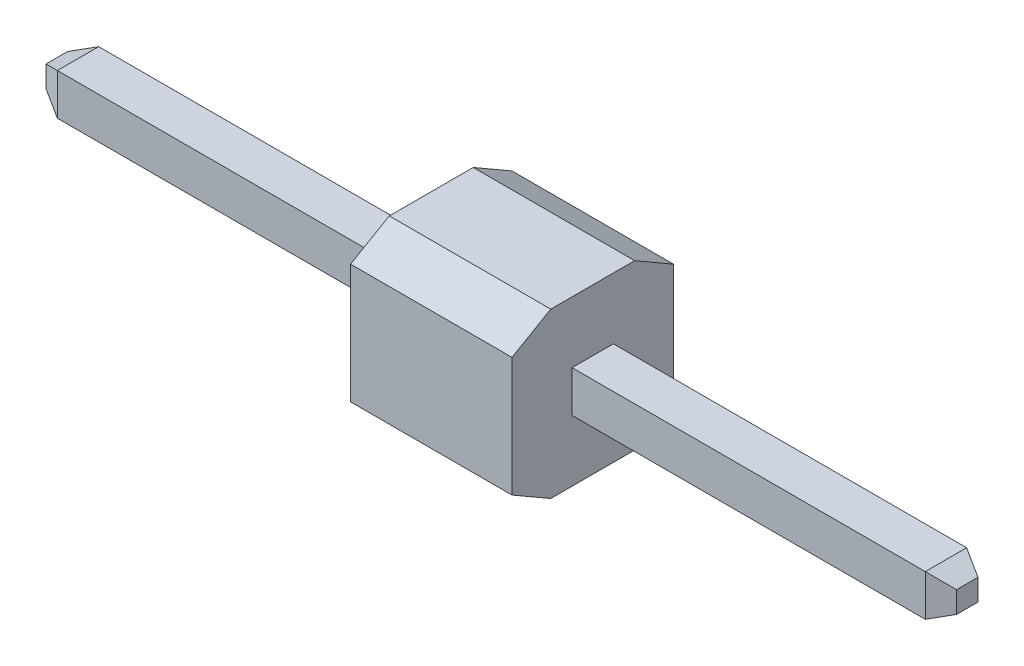
ISO-10303-21;
HEADER;
FILE_DESCRIPTION(('STEP AP214'),'2;1');
FILE_NAME('part.step','',(''),(''),'','','');
FILE_SCHEMA(('AUTOMOTIVE_DESIGN { 1 0 10303 214 1 1 1 1 }'));
ENDSEC;
DATA;
#1=APPLICATION_CONTEXT('core data for automotive mechanical design processes');
#2=APPLICATION_PROTOCOL_DEFINITION('international standard','automotive_design',2000,#1);
#3=PRODUCT_CONTEXT('',#1,'mechanical');
#4=PRODUCT('Part','Part','',(#3));
#5=PRODUCT_RELATED_PRODUCT_CATEGORY('part','',(#4));
#6=PRODUCT_DEFINITION_FORMATION('','',#4);
#7=PRODUCT_DEFINITION_CONTEXT('part definition',#1,'design');
#8=PRODUCT_DEFINITION('design','',#6,#7);
#9=PRODUCT_DEFINITION_SHAPE('','',#8);
#10=(LENGTH_UNIT() NAMED_UNIT(*) SI_UNIT(.MILLI.,.METRE.));
#11=(NAMED_UNIT(*) PLANE_ANGLE_UNIT() SI_UNIT($,.RADIAN.));
#12=(NAMED_UNIT(*) SI_UNIT($,.STERADIAN.) SOLID_ANGLE_UNIT());
#13=UNCERTAINTY_MEASURE_WITH_UNIT(LENGTH_MEASURE(1.E-05),#10,'distance_accuracy_value','');
#14=(GEOMETRIC_REPRESENTATION_CONTEXT(3) GLOBAL_UNCERTAINTY_ASSIGNED_CONTEXT((#13)) GLOBAL_UNIT_ASSIGNED_CONTEXT((#10,
#11,#12)) REPRESENTATION_CONTEXT('',''));
#15=CARTESIAN_POINT('',(0.,0.,0.));
#16=DIRECTION('',(0.,0.,1.));
#17=DIRECTION('',(1.,0.,0.));
#18=AXIS2_PLACEMENT_3D('',#15,#16,#17);
#19=CARTESIAN_POINT('',(5.42105186596663,10.477121448103,-2.62999914262417));
#20=DIRECTION('',(1.,-9.93476518829084E-08,4.37113882867379E-08));
#21=DIRECTION('',(-9.93476589883358E-08,-1.,8.74227765734759E-08));
#22=AXIS2_PLACEMENT_3D('',#19,#20,#21);
#23=PLANE('',#22);
#24=DIRECTION('',(-1.18186619959584E-08,-0.50000007571054,-0.866025360072934));
#25=VECTOR('',#24,1.);
#26=CARTESIAN_POINT('',(5.42105167379203,9.23353174686681,-1.05999903390609));
#27=LINE('',#26,#25);
#28=CARTESIAN_POINT('',(5.42105167379203,9.23353174686681,-1.05999903390609));
#29=VERTEX_POINT('',#28);
#30=CARTESIAN_POINT('',(5.42105166560382,8.88712153290314,-1.65999900362196));
#31=VERTEX_POINT('',#30);
#32=EDGE_CURVE('E11',#29,#31,#27,.T.);
#33=ORIENTED_EDGE('',*,*,#32,.T.);
#34=DIRECTION('',(4.37113811813104E-08,-8.74227842254741E-08,-0.999999999999995));
#35=VECTOR('',#34,1.);
#36=CARTESIAN_POINT('',(5.42105166560382,8.88712153290314,-1.65999900362196));
#37=LINE('',#36,#35);
#38=CARTESIAN_POINT('',(5.42105172242861,8.88712141925352,-2.95999900362196));
#39=VERTEX_POINT('',#38);
#40=EDGE_CURVE('E304',#31,#39,#37,.T.);
#41=ORIENTED_EDGE('',*,*,#40,.T.);
#42=DIRECTION('',(8.75289950712042E-08,0.499999924289839,-0.866025447495712));
#43=VECTOR('',#42,1.);
#44=CARTESIAN_POINT('',(5.42105172242861,8.88712141925352,-2.95999900362196));
#45=LINE('',#44,#43);
#46=CARTESIAN_POINT('',(5.42105178307048,9.23353152830985,-3.55999903390609));
#47=VERTEX_POINT('',#46);
#48=EDGE_CURVE('E296',#39,#47,#45,.T.);
#49=ORIENTED_EDGE('',*,*,#48,.T.);
#50=DIRECTION('',(9.93476593244772E-08,0.999999999999991,-8.74227767226935E-08));
#51=VECTOR('',#50,1.);
#52=CARTESIAN_POINT('',(5.42105178307048,9.23353152830985,-3.55999903390609));
#53=LINE('',#52,#51);
#54=CARTESIAN_POINT('',(5.42105196658346,11.0807112052799,-3.55999919539167));
#55=VERTEX_POINT('',#54);
#56=EDGE_CURVE('E281',#47,#55,#53,.T.);
#57=ORIENTED_EDGE('',*,*,#56,.T.);
#58=DIRECTION('',(-1.18186619958732E-08,-0.500000075710534,-0.866025360072937));
#59=VECTOR('',#58,1.);
#60=CARTESIAN_POINT('',(5.42105197477167,11.4271214192535,-2.95999922567581));
#61=LINE('',#60,#59);
#62=CARTESIAN_POINT('',(5.42105197477167,11.4271214192535,-2.95999922567581));
#63=VERTEX_POINT('',#62);
#64=EDGE_CURVE('E265',#63,#55,#61,.T.);
#65=ORIENTED_EDGE('',*,*,#64,.F.);
#66=DIRECTION('',(4.37113811813104E-08,-8.74227842254741E-08,-0.999999999999995));
#67=VECTOR('',#66,1.);
#68=CARTESIAN_POINT('',(5.42105191794687,11.4271215329031,-1.65999922567581));
#69=LINE('',#68,#67);
#70=CARTESIAN_POINT('',(5.42105191794687,11.4271215329031,-1.65999922567581));
#71=VERTEX_POINT('',#70);
#72=EDGE_CURVE('E248',#71,#63,#69,.T.);
#73=ORIENTED_EDGE('',*,*,#72,.F.);
#74=DIRECTION('',(8.7528995070573E-08,0.499999924289833,-0.866025447495715));
#75=VECTOR('',#74,1.);
#76=CARTESIAN_POINT('',(5.421051857305,11.0807114238368,-1.05999919539167));
#77=LINE('',#76,#75);
#78=CARTESIAN_POINT('',(5.421051857305,11.0807114238368,-1.05999919539167));
#79=VERTEX_POINT('',#78);
#80=EDGE_CURVE('E242',#79,#71,#77,.T.);
#81=ORIENTED_EDGE('',*,*,#80,.F.);
#82=DIRECTION('',(9.93476593244772E-08,0.999999999999991,-8.74227763620714E-08));
#83=VECTOR('',#82,1.);
#84=CARTESIAN_POINT('',(5.42105167379203,9.23353174686681,-1.05999903390609));
#85=LINE('',#84,#83);
#86=EDGE_CURVE('E236',#29,#79,#85,.T.);
#87=ORIENTED_EDGE('',*,*,#86,.F.);
#88=EDGE_LOOP('',(#33,#41,#49,#57,#65,#73,#81,#87));
#89=FACE_BOUND('',#88,.T.);
#90=DIRECTION('',(-4.37113803486431E-08,8.74227856773043E-08,0.999999999999995));
#91=VECTOR('',#90,1.);
#92=CARTESIAN_POINT('',(5.42105180238413,9.83712144810304,-2.62999908667359));
#93=LINE('',#92,#91);
#94=CARTESIAN_POINT('',(5.42105180238413,9.83712144810304,-2.62999908667359));
#95=VERTEX_POINT('',#94);
#96=CARTESIAN_POINT('',(5.42105177440885,9.83712150405362,-1.98999908667359));
#97=VERTEX_POINT('',#96);
#98=EDGE_CURVE('E302',#95,#97,#93,.T.);
#99=ORIENTED_EDGE('',*,*,#98,.T.);
#100=DIRECTION('',(-9.93476592658906E-08,-0.999999999999991,8.74227763097971E-08));
#101=VECTOR('',#100,1.);
#102=CARTESIAN_POINT('',(5.42105183799135,10.4771215040536,-1.98999914262417));
#103=LINE('',#102,#101);
#104=CARTESIAN_POINT('',(5.42105183799135,10.4771215040536,-1.98999914262417));
#105=VERTEX_POINT('',#104);
#106=EDGE_CURVE('E293',#105,#97,#103,.T.);
#107=ORIENTED_EDGE('',*,*,#106,.F.);
#108=DIRECTION('',(-4.37113803486431E-08,8.74227856773042E-08,0.999999999999995));
#109=VECTOR('',#108,1.);
#110=CARTESIAN_POINT('',(5.42105186596663,10.477121448103,-2.62999914262417));
#111=LINE('',#110,#109);
#112=CARTESIAN_POINT('',(5.42105186596663,10.477121448103,-2.62999914262417));
#113=VERTEX_POINT('',#112);
#114=EDGE_CURVE('E278',#113,#105,#111,.T.);
#115=ORIENTED_EDGE('',*,*,#114,.F.);
#116=DIRECTION('',(-9.93476592658906E-08,-0.999999999999991,8.74227766567418E-08));
#117=VECTOR('',#116,1.);
#118=CARTESIAN_POINT('',(5.42105186596663,10.477121448103,-2.62999914262417));
#119=LINE('',#118,#117);
#120=EDGE_CURVE('E263',#113,#95,#119,.T.);
#121=ORIENTED_EDGE('',*,*,#120,.T.);
#122=EDGE_LOOP('',(#99,#107,#115,#121));
#123=FACE_BOUND('',#122,.T.);
#124=ADVANCED_FACE('F17',(#89,#123),#23,.T.);
#125=CARTESIAN_POINT('',(2.92105186596663,10.4771216964722,-2.62999925190264));
#126=DIRECTION('',(1.,-9.93476518829084E-08,4.37113882867379E-08));
#127=DIRECTION('',(-9.93476589883358E-08,-1.,8.74227765734759E-08));
#128=AXIS2_PLACEMENT_3D('',#125,#126,#127);
#129=PLANE('',#128);
#130=DIRECTION('',(-1.18186632779335E-08,-0.50000007571054,-0.866025360072934));
#131=VECTOR('',#130,1.);
#132=CARTESIAN_POINT('',(2.92105167379203,9.23353199523594,-1.05999914318456));
#133=LINE('',#132,#131);
#134=CARTESIAN_POINT('',(2.92105167379203,9.23353199523594,-1.05999914318456));
#135=VERTEX_POINT('',#134);
#136=CARTESIAN_POINT('',(2.92105166560382,8.88712178127227,-1.65999911290043));
#137=VERTEX_POINT('',#136);
#138=EDGE_CURVE('E24',#135,#137,#133,.T.);
#139=ORIENTED_EDGE('',*,*,#138,.F.);
#140=DIRECTION('',(9.93476588436478E-08,0.999999999999991,-8.74227763620714E-08));
#141=VECTOR('',#140,1.);
#142=CARTESIAN_POINT('',(2.92105167379203,9.23353199523594,-1.05999914318456));
#143=LINE('',#142,#141);
#144=CARTESIAN_POINT('',(2.921051857305,11.0807116722059,-1.05999930467014));
#145=VERTEX_POINT('',#144);
#146=EDGE_CURVE('E300',#135,#145,#143,.T.);
#147=ORIENTED_EDGE('',*,*,#146,.T.);
#148=DIRECTION('',(8.75289963525482E-08,0.499999924289833,-0.866025447495715));
#149=VECTOR('',#148,1.);
#150=CARTESIAN_POINT('',(2.921051857305,11.0807116722059,-1.05999930467014));
#151=LINE('',#150,#149);
#152=CARTESIAN_POINT('',(2.92105191794687,11.4271217812723,-1.65999933495428));
#153=VERTEX_POINT('',#152);
#154=EDGE_CURVE('E286',#145,#153,#151,.T.);
#155=ORIENTED_EDGE('',*,*,#154,.T.);
#156=DIRECTION('',(4.37113811813104E-08,-8.74227842254741E-08,-0.999999999999995));
#157=VECTOR('',#156,1.);
#158=CARTESIAN_POINT('',(2.92105191794687,11.4271217812723,-1.65999933495428));
#159=LINE('',#158,#157);
#160=CARTESIAN_POINT('',(2.92105197477167,11.4271216676226,-2.95999933495428));
#161=VERTEX_POINT('',#160);
#162=EDGE_CURVE('E271',#153,#161,#159,.T.);
#163=ORIENTED_EDGE('',*,*,#162,.T.);
#164=DIRECTION('',(-1.18186632778483E-08,-0.500000075710534,-0.866025360072937));
#165=VECTOR('',#164,1.);
#166=CARTESIAN_POINT('',(2.92105197477167,11.4271216676226,-2.95999933495428));
#167=LINE('',#166,#165);
#168=CARTESIAN_POINT('',(2.92105196658346,11.080711453649,-3.55999930467014));
#169=VERTEX_POINT('',#168);
#170=EDGE_CURVE('E253',#161,#169,#167,.T.);
#171=ORIENTED_EDGE('',*,*,#170,.T.);
#172=DIRECTION('',(9.93476588436478E-08,0.999999999999991,-8.74227767226935E-08));
#173=VECTOR('',#172,1.);
#174=CARTESIAN_POINT('',(2.92105178307048,9.23353177667898,-3.55999914318456));
#175=LINE('',#174,#173);
#176=CARTESIAN_POINT('',(2.92105178307048,9.23353177667898,-3.55999914318456));
#177=VERTEX_POINT('',#176);
#178=EDGE_CURVE('E261',#177,#169,#175,.T.);
#179=ORIENTED_EDGE('',*,*,#178,.F.);
#180=DIRECTION('',(8.75289963531793E-08,0.499999924289839,-0.866025447495712));
#181=VECTOR('',#180,1.);
#182=CARTESIAN_POINT('',(2.92105172242861,8.88712166762265,-2.95999911290043));
#183=LINE('',#182,#181);
#184=CARTESIAN_POINT('',(2.92105172242861,8.88712166762265,-2.95999911290043));
#185=VERTEX_POINT('',#184);
#186=EDGE_CURVE('E276',#185,#177,#183,.T.);
#187=ORIENTED_EDGE('',*,*,#186,.F.);
#188=DIRECTION('',(4.37113811813104E-08,-8.74227842254741E-08,-0.999999999999995));
#189=VECTOR('',#188,1.);
#190=CARTESIAN_POINT('',(2.92105166560382,8.88712178127227,-1.65999911290043));
#191=LINE('',#190,#189);
#192=EDGE_CURVE('E291',#137,#185,#191,.T.);
#193=ORIENTED_EDGE('',*,*,#192,.F.);
#194=EDGE_LOOP('',(#139,#147,#155,#163,#171,#179,#187,#193));
#195=FACE_BOUND('',#194,.T.);
#196=DIRECTION('',(-9.93476585720012E-08,-0.999999999999991,8.74227763097971E-08));
#197=VECTOR('',#196,1.);
#198=CARTESIAN_POINT('',(2.92105183799135,10.4771217524227,-1.98999925190264));
#199=LINE('',#198,#197);
#200=CARTESIAN_POINT('',(2.92105183799135,10.4771217524227,-1.98999925190264));
#201=VERTEX_POINT('',#200);
#202=CARTESIAN_POINT('',(2.92105177440885,9.83712175242275,-1.98999919595206));
#203=VERTEX_POINT('',#202);
#204=EDGE_CURVE('E298',#201,#203,#199,.T.);
#205=ORIENTED_EDGE('',*,*,#204,.T.);
#206=DIRECTION('',(-4.37113810425325E-08,8.74227856773043E-08,0.999999999999995));
#207=VECTOR('',#206,1.);
#208=CARTESIAN_POINT('',(2.92105180238413,9.83712169647217,-2.62999919595206));
#209=LINE('',#208,#207);
#210=CARTESIAN_POINT('',(2.92105180238413,9.83712169647217,-2.62999919595206));
#211=VERTEX_POINT('',#210);
#212=EDGE_CURVE('E283',#211,#203,#209,.T.);
#213=ORIENTED_EDGE('',*,*,#212,.F.);
#214=DIRECTION('',(-9.93476585720012E-08,-0.999999999999991,8.74227766567418E-08));
#215=VECTOR('',#214,1.);
#216=CARTESIAN_POINT('',(2.92105186596663,10.4771216964722,-2.62999925190264));
#217=LINE('',#216,#215);
#218=CARTESIAN_POINT('',(2.92105186596663,10.4771216964722,-2.62999925190264));
#219=VERTEX_POINT('',#218);
#220=EDGE_CURVE('E268',#219,#211,#217,.T.);
#221=ORIENTED_EDGE('',*,*,#220,.F.);
#222=DIRECTION('',(-4.37113810425325E-08,8.74227856773042E-08,0.999999999999995));
#223=VECTOR('',#222,1.);
#224=CARTESIAN_POINT('',(2.92105186596663,10.4771216964722,-2.62999925190264));
#225=LINE('',#224,#223);
#226=EDGE_CURVE('E251',#219,#201,#225,.T.);
#227=ORIENTED_EDGE('',*,*,#226,.T.);
#228=EDGE_LOOP('',(#205,#213,#221,#227));
#229=FACE_BOUND('',#228,.T.);
#230=ADVANCED_FACE('F314',(#195,#229),#129,.F.);
#231=CARTESIAN_POINT('',(5.42105167379203,9.23353174686681,-1.05999903390609));
#232=DIRECTION('',(1.07893287081065E-07,0.866025360072937,-0.500000075710535));
#233=DIRECTION('',(1.18186629566715E-08,0.500000075710542,0.866025360072941));
#234=AXIS2_PLACEMENT_3D('',#231,#232,#233);
#235=PLANE('',#234);
#236=ORIENTED_EDGE('',*,*,#138,.T.);
#237=DIRECTION('',(-0.999999999999994,9.93476504618223E-08,-4.37113884643734E-08));
#238=VECTOR('',#237,1.);
#239=CARTESIAN_POINT('',(5.42105166560382,8.88712153290314,-1.65999900362196));
#240=LINE('',#239,#238);
#241=EDGE_CURVE('E288',#31,#137,#240,.T.);
#242=ORIENTED_EDGE('',*,*,#241,.F.);
#243=ORIENTED_EDGE('',*,*,#32,.F.);
#244=DIRECTION('',(-0.999999999999994,9.93476533039933E-08,-4.3711388109102E-08));
#245=VECTOR('',#244,1.);
#246=CARTESIAN_POINT('',(5.42105167379203,9.23353174686681,-1.05999903390609));
#247=LINE('',#246,#245);
#248=EDGE_CURVE('E256',#29,#135,#247,.T.);
#249=ORIENTED_EDGE('',*,*,#248,.T.);
#250=EDGE_LOOP('',(#236,#242,#243,#249));
#251=FACE_BOUND('',#250,.T.);
#252=ADVANCED_FACE('F306',(#251),#235,.F.);
#253=CARTESIAN_POINT('',(5.42105166560382,8.88712153290314,-1.65999900362196));
#254=DIRECTION('',(9.93476589883358E-08,1.,-8.74227765734759E-08));
#255=DIRECTION('',(1.,-9.93476518829084E-08,4.37113882867379E-08));
#256=AXIS2_PLACEMENT_3D('',#253,#254,#255);
#257=PLANE('',#256);
#258=ORIENTED_EDGE('',*,*,#192,.T.);
#259=DIRECTION('',(-0.999999999999994,9.93476504618223E-08,-4.37113882867377E-08));
#260=VECTOR('',#259,1.);
#261=CARTESIAN_POINT('',(5.42105172242861,8.88712141925352,-2.95999900362196));
#262=LINE('',#261,#260);
#263=EDGE_CURVE('E273',#39,#185,#262,.T.);
#264=ORIENTED_EDGE('',*,*,#263,.F.);
#265=ORIENTED_EDGE('',*,*,#40,.F.);
#266=ORIENTED_EDGE('',*,*,#241,.T.);
#267=EDGE_LOOP('',(#258,#264,#265,#266));
#268=FACE_BOUND('',#267,.T.);
#269=ADVANCED_FACE('F311',(#268),#257,.F.);
#270=CARTESIAN_POINT('',(5.42105172242861,8.88712141925352,-2.95999900362196));
#271=DIRECTION('',(6.41819058997377E-08,0.866025447495721,0.499999924289845));
#272=DIRECTION('',(-8.7528996031702E-08,-0.499999924289838,0.866025447495717));
#273=AXIS2_PLACEMENT_3D('',#270,#271,#272);
#274=PLANE('',#273);
#275=ORIENTED_EDGE('',*,*,#186,.T.);
#276=DIRECTION('',(-0.999999999999994,9.93476533039933E-08,-4.37113884643734E-08));
#277=VECTOR('',#276,1.);
#278=CARTESIAN_POINT('',(5.42105178307048,9.23353152830985,-3.55999903390609));
#279=LINE('',#278,#277);
#280=EDGE_CURVE('E258',#47,#177,#279,.T.);
#281=ORIENTED_EDGE('',*,*,#280,.F.);
#282=ORIENTED_EDGE('',*,*,#48,.F.);
#283=ORIENTED_EDGE('',*,*,#263,.T.);
#284=EDGE_LOOP('',(#275,#281,#282,#283));
#285=FACE_BOUND('',#284,.T.);
#286=ADVANCED_FACE('F319',(#285),#274,.F.);
#287=CARTESIAN_POINT('',(5.42105178307048,9.23353152830985,-3.55999903390609));
#288=DIRECTION('',(-4.37113811813106E-08,8.74227836789032E-08,1.));
#289=DIRECTION('',(-1.,9.93476518829084E-08,-4.37113882867379E-08));
#290=AXIS2_PLACEMENT_3D('',#287,#288,#289);
#291=PLANE('',#290);
#292=ORIENTED_EDGE('',*,*,#178,.T.);
#293=DIRECTION('',(-0.999999999999994,9.93476533039933E-08,-4.37113882867377E-08));
#294=VECTOR('',#293,1.);
#295=CARTESIAN_POINT('',(5.42105196658346,11.0807112052799,-3.55999919539167));
#296=LINE('',#295,#294);
#297=EDGE_CURVE('E245',#55,#169,#296,.T.);
#298=ORIENTED_EDGE('',*,*,#297,.F.);
#299=ORIENTED_EDGE('',*,*,#56,.F.);
#300=ORIENTED_EDGE('',*,*,#280,.T.);
#301=EDGE_LOOP('',(#292,#298,#299,#300));
#302=FACE_BOUND('',#301,.T.);
#303=ADVANCED_FACE('F326',(#302),#291,.F.);
#304=CARTESIAN_POINT('',(5.42105197477167,11.4271214192535,-2.95999922567581));
#305=DIRECTION('',(1.07893287081065E-07,0.866025360072937,-0.500000075710535));
#306=DIRECTION('',(1.18186629566715E-08,0.500000075710542,0.866025360072941));
#307=AXIS2_PLACEMENT_3D('',#304,#305,#306);
#308=PLANE('',#307);
#309=ORIENTED_EDGE('',*,*,#170,.F.);
#310=DIRECTION('',(-0.999999999999994,9.93476533039933E-08,-4.37113884643734E-08));
#311=VECTOR('',#310,1.);
#312=CARTESIAN_POINT('',(5.42105197477167,11.4271214192535,-2.95999922567581));
#313=LINE('',#312,#311);
#314=EDGE_CURVE('E239',#63,#161,#313,.T.);
#315=ORIENTED_EDGE('',*,*,#314,.F.);
#316=ORIENTED_EDGE('',*,*,#64,.T.);
#317=ORIENTED_EDGE('',*,*,#297,.T.);
#318=EDGE_LOOP('',(#309,#315,#316,#317));
#319=FACE_BOUND('',#318,.T.);
#320=ADVANCED_FACE('F329',(#319),#308,.T.);
#321=CARTESIAN_POINT('',(5.42105191794687,11.4271215329031,-1.65999922567581));
#322=DIRECTION('',(9.93476589883358E-08,1.,-8.74227765734759E-08));
#323=DIRECTION('',(1.,-9.93476518829084E-08,4.37113882867379E-08));
#324=AXIS2_PLACEMENT_3D('',#321,#322,#323);
#325=PLANE('',#324);
#326=ORIENTED_EDGE('',*,*,#162,.F.);
#327=DIRECTION('',(-0.999999999999994,9.93476533039933E-08,-4.37113883755555E-08));
#328=VECTOR('',#327,1.);
#329=CARTESIAN_POINT('',(5.42105191794687,11.4271215329031,-1.65999922567581));
#330=LINE('',#329,#328);
#331=EDGE_CURVE('E233',#71,#153,#330,.T.);
#332=ORIENTED_EDGE('',*,*,#331,.F.);
#333=ORIENTED_EDGE('',*,*,#72,.T.);
#334=ORIENTED_EDGE('',*,*,#314,.T.);
#335=EDGE_LOOP('',(#326,#332,#333,#334));
#336=FACE_BOUND('',#335,.T.);
#337=ADVANCED_FACE('F333',(#336),#325,.T.);
#338=CARTESIAN_POINT('',(5.421051857305,11.0807114238368,-1.05999919539167));
#339=DIRECTION('',(6.41819058997377E-08,0.866025447495721,0.499999924289845));
#340=DIRECTION('',(-8.7528996031702E-08,-0.499999924289838,0.866025447495717));
#341=AXIS2_PLACEMENT_3D('',#338,#339,#340);
#342=PLANE('',#341);
#343=ORIENTED_EDGE('',*,*,#154,.F.);
#344=DIRECTION('',(-0.999999999999994,9.93476533039933E-08,-4.3711388109102E-08));
#345=VECTOR('',#344,1.);
#346=CARTESIAN_POINT('',(5.421051857305,11.0807114238368,-1.05999919539167));
#347=LINE('',#346,#345);
#348=EDGE_CURVE('E230',#79,#145,#347,.T.);
#349=ORIENTED_EDGE('',*,*,#348,.F.);
#350=ORIENTED_EDGE('',*,*,#80,.T.);
#351=ORIENTED_EDGE('',*,*,#331,.T.);
#352=EDGE_LOOP('',(#343,#349,#350,#351));
#353=FACE_BOUND('',#352,.T.);
#354=ADVANCED_FACE('F337',(#353),#342,.T.);
#355=CARTESIAN_POINT('',(5.42105167379203,9.23353174686681,-1.05999903390609));
#356=DIRECTION('',(-4.37113811813106E-08,8.74227835615132E-08,1.));
#357=DIRECTION('',(-9.93476589883358E-08,-1.,8.74227764560859E-08));
#358=AXIS2_PLACEMENT_3D('',#355,#356,#357);
#359=PLANE('',#358);
#360=ORIENTED_EDGE('',*,*,#146,.F.);
#361=ORIENTED_EDGE('',*,*,#248,.F.);
#362=ORIENTED_EDGE('',*,*,#86,.T.);
#363=ORIENTED_EDGE('',*,*,#348,.T.);
#364=EDGE_LOOP('',(#360,#361,#362,#363));
#365=FACE_BOUND('',#364,.T.);
#366=ADVANCED_FACE('F339',(#365),#359,.T.);
#367=CARTESIAN_POINT('',(-2.87894813403337,10.4771222726885,-2.62999950542869));
#368=DIRECTION('',(-1.,9.93476518829084E-08,-4.37113882867379E-08));
#369=DIRECTION('',(9.93476589883358E-08,1.,-8.74227765734759E-08));
#370=AXIS2_PLACEMENT_3D('',#367,#368,#369);
#371=PLANE('',#370);
#372=DIRECTION('',(9.93476608211201E-08,0.999999999999991,-8.74227774781761E-08));
#373=VECTOR('',#372,1.);
#374=CARTESIAN_POINT('',(-2.87894820357701,9.99100384237638,-2.14388099012187));
#375=LINE('',#374,#373);
#376=CARTESIAN_POINT('',(-2.87894820357701,9.99100384237638,-2.14388099012187));
#377=VERTEX_POINT('',#376);
#378=CARTESIAN_POINT('',(-2.87894817057004,10.3232407879864,-2.14388101916694));
#379=VERTEX_POINT('',#378);
#380=EDGE_CURVE('E228',#377,#379,#375,.T.);
#381=ORIENTED_EDGE('',*,*,#380,.T.);
#382=DIRECTION('',(4.37113820547149E-08,-8.7422774802743E-08,-0.999999999999995));
#383=VECTOR('',#382,1.);
#384=CARTESIAN_POINT('',(-2.87894817057005,10.3232407879864,-2.14388101916694));
#385=LINE('',#384,#383);
#386=CARTESIAN_POINT('',(-2.87894815604751,10.3232407589413,-2.47611796478494));
#387=VERTEX_POINT('',#386);
#388=EDGE_CURVE('E223',#379,#387,#385,.T.);
#389=ORIENTED_EDGE('',*,*,#388,.T.);
#390=DIRECTION('',(-9.93476608211201E-08,-0.999999999999991,8.7422776141512E-08));
#391=VECTOR('',#390,1.);
#392=CARTESIAN_POINT('',(-2.87894815604751,10.3232407589413,-2.47611796478494));
#393=LINE('',#392,#391);
#394=CARTESIAN_POINT('',(-2.87894818905447,9.9910038133313,-2.47611793573987));
#395=VERTEX_POINT('',#394);
#396=EDGE_CURVE('E215',#387,#395,#393,.T.);
#397=ORIENTED_EDGE('',*,*,#396,.T.);
#398=DIRECTION('',(-4.37113767080583E-08,8.74227854960559E-08,0.999999999999995));
#399=VECTOR('',#398,1.);
#400=CARTESIAN_POINT('',(-2.87894818905447,9.9910038133313,-2.47611793573987));
#401=LINE('',#400,#399);
#402=EDGE_CURVE('E207',#395,#377,#401,.T.);
#403=ORIENTED_EDGE('',*,*,#402,.T.);
#404=EDGE_LOOP('',(#381,#389,#397,#403));
#405=FACE_BOUND('',#404,.T.);
#406=ADVANCED_FACE('F341',(#405),#371,.T.);
#407=CARTESIAN_POINT('',(-2.87894813403337,10.4771222726885,-2.62999950542869));
#408=DIRECTION('',(9.93476589883358E-08,1.,-8.74227764510112E-08));
#409=DIRECTION('',(-4.37113811813106E-08,8.74227835564385E-08,1.));
#410=AXIS2_PLACEMENT_3D('',#407,#408,#409);
#411=PLANE('',#410);
#412=DIRECTION('',(0.999999999999994,-9.93476521037346E-08,4.37113882769953E-08));
#413=VECTOR('',#412,1.);
#414=CARTESIAN_POINT('',(-2.54894813403337,10.4771222399038,-2.62999949100394));
#415=LINE('',#414,#413);
#416=CARTESIAN_POINT('',(-2.54894813403337,10.4771222399038,-2.62999949100394));
#417=VERTEX_POINT('',#416);
#418=EDGE_CURVE('E225',#417,#219,#415,.T.);
#419=ORIENTED_EDGE('',*,*,#418,.F.);
#420=DIRECTION('',(-4.37113803486431E-08,8.74227856773042E-08,0.999999999999995));
#421=VECTOR('',#420,1.);
#422=CARTESIAN_POINT('',(-2.54894813403337,10.4771222399038,-2.62999949100394));
#423=LINE('',#422,#421);
#424=CARTESIAN_POINT('',(-2.54894816200865,10.4771222958544,-1.98999949100394));
#425=VERTEX_POINT('',#424);
#426=EDGE_CURVE('E217',#417,#425,#423,.T.);
#427=ORIENTED_EDGE('',*,*,#426,.T.);
#428=DIRECTION('',(0.999999999999994,-9.93476521037346E-08,4.3711388195809E-08));
#429=VECTOR('',#428,1.);
#430=CARTESIAN_POINT('',(-2.54894816200865,10.4771222958544,-1.98999949100394));
#431=LINE('',#430,#429);
#432=EDGE_CURVE('E220',#425,#201,#431,.T.);
#433=ORIENTED_EDGE('',*,*,#432,.T.);
#434=ORIENTED_EDGE('',*,*,#226,.F.);
#435=EDGE_LOOP('',(#419,#427,#433,#434));
#436=FACE_BOUND('',#435,.T.);
#437=ADVANCED_FACE('F348',(#436),#411,.T.);
#438=CARTESIAN_POINT('',(-2.87894816200865,10.4771223286391,-1.98999950542869));
#439=DIRECTION('',(-4.37113811813106E-08,8.74227836789032E-08,1.));
#440=DIRECTION('',(-1.,9.93476518829084E-08,-4.37113882867379E-08));
#441=AXIS2_PLACEMENT_3D('',#438,#439,#440);
#442=PLANE('',#441);
#443=ORIENTED_EDGE('',*,*,#432,.F.);
#444=DIRECTION('',(-9.93476592658906E-08,-0.999999999999991,8.74227763097971E-08));
#445=VECTOR('',#444,1.);
#446=CARTESIAN_POINT('',(-2.54894816200865,10.4771222958544,-1.98999949100394));
#447=LINE('',#446,#445);
#448=CARTESIAN_POINT('',(-2.54894822559115,9.83712229585441,-1.98999943505336));
#449=VERTEX_POINT('',#448);
#450=EDGE_CURVE('E209',#425,#449,#447,.T.);
#451=ORIENTED_EDGE('',*,*,#450,.T.);
#452=DIRECTION('',(0.999999999999994,-9.93476547016971E-08,4.37113882364022E-08));
#453=VECTOR('',#452,1.);
#454=CARTESIAN_POINT('',(-2.54894822559115,9.83712229585441,-1.98999943505336));
#455=LINE('',#454,#453);
#456=EDGE_CURVE('E212',#449,#203,#455,.T.);
#457=ORIENTED_EDGE('',*,*,#456,.T.);
#458=ORIENTED_EDGE('',*,*,#204,.F.);
#459=EDGE_LOOP('',(#443,#451,#457,#458));
#460=FACE_BOUND('',#459,.T.);
#461=ADVANCED_FACE('F424',(#460),#442,.T.);
#462=CARTESIAN_POINT('',(-2.87894819761587,9.83712227268855,-2.62999944947812));
#463=DIRECTION('',(9.93476589883357E-08,1.,-8.74227764040693E-08));
#464=DIRECTION('',(-4.37113811813106E-08,8.74227835094966E-08,1.));
#465=AXIS2_PLACEMENT_3D('',#462,#463,#464);
#466=PLANE('',#465);
#467=ORIENTED_EDGE('',*,*,#456,.F.);
#468=DIRECTION('',(4.37113817364219E-08,-8.74227967795345E-08,-0.999999999999995));
#469=VECTOR('',#468,1.);
#470=CARTESIAN_POINT('',(-2.54894822559115,9.83712229585441,-1.98999943505336));
#471=LINE('',#470,#469);
#472=CARTESIAN_POINT('',(-2.54894819761587,9.83712223990382,-2.62999943505336));
#473=VERTEX_POINT('',#472);
#474=EDGE_CURVE('E201',#449,#473,#471,.T.);
#475=ORIENTED_EDGE('',*,*,#474,.T.);
#476=DIRECTION('',(0.999999999999994,-9.93476547016971E-08,4.37113882769953E-08));
#477=VECTOR('',#476,1.);
#478=CARTESIAN_POINT('',(-2.54894819761587,9.83712223990382,-2.62999943505336));
#479=LINE('',#478,#477);
#480=EDGE_CURVE('E204',#473,#211,#479,.T.);
#481=ORIENTED_EDGE('',*,*,#480,.T.);
#482=ORIENTED_EDGE('',*,*,#212,.T.);
#483=EDGE_LOOP('',(#467,#475,#481,#482));
#484=FACE_BOUND('',#483,.T.);
#485=ADVANCED_FACE('F421',(#484),#466,.F.);
#486=CARTESIAN_POINT('',(-2.87894813403337,10.4771222726885,-2.62999950542869));
#487=DIRECTION('',(-4.37113811813106E-08,8.74227836789032E-08,1.));
#488=DIRECTION('',(-1.,9.93476518829084E-08,-4.37113882867379E-08));
#489=AXIS2_PLACEMENT_3D('',#486,#487,#488);
#490=PLANE('',#489);
#491=ORIENTED_EDGE('',*,*,#480,.F.);
#492=DIRECTION('',(9.93476578781123E-08,0.999999999999991,-8.74227766567422E-08));
#493=VECTOR('',#492,1.);
#494=CARTESIAN_POINT('',(-2.54894819761587,9.83712223990383,-2.62999943505336));
#495=LINE('',#494,#493);
#496=EDGE_CURVE('E196',#473,#417,#495,.T.);
#497=ORIENTED_EDGE('',*,*,#496,.T.);
#498=ORIENTED_EDGE('',*,*,#418,.T.);
#499=ORIENTED_EDGE('',*,*,#220,.T.);
#500=EDGE_LOOP('',(#491,#497,#498,#499));
#501=FACE_BOUND('',#500,.T.);
#502=ADVANCED_FACE('F376',(#501),#490,.F.);
#503=CARTESIAN_POINT('',(-2.87894813403337,10.4771222726885,-2.62999950542869));
#504=DIRECTION('',(-4.37113811813106E-08,8.74227836789032E-08,1.));
#505=DIRECTION('',(-1.,9.93476518829084E-08,-4.37113882867379E-08));
#506=AXIS2_PLACEMENT_3D('',#503,#504,#505);
#507=PLANE('',#506);
#508=DIRECTION('',(0.999999999999994,-9.93476469078097E-08,4.37113882769953E-08));
#509=VECTOR('',#508,1.);
#510=CARTESIAN_POINT('',(5.42105186596663,10.477121448103,-2.62999914262417));
#511=LINE('',#510,#509);
#512=CARTESIAN_POINT('',(10.8910518659666,10.4771209046714,-2.62999890352288));
#513=VERTEX_POINT('',#512);
#514=EDGE_CURVE('E199',#113,#513,#511,.T.);
#515=ORIENTED_EDGE('',*,*,#514,.T.);
#516=DIRECTION('',(-9.93476606536693E-08,-0.999999999999991,8.74227766567418E-08));
#517=VECTOR('',#516,1.);
#518=CARTESIAN_POINT('',(10.8910518659666,10.4771209046714,-2.62999890352288));
#519=LINE('',#518,#517);
#520=CARTESIAN_POINT('',(10.8910518023841,9.83712090467138,-2.6299988475723));
#521=VERTEX_POINT('',#520);
#522=EDGE_CURVE('E191',#513,#521,#519,.T.);
#523=ORIENTED_EDGE('',*,*,#522,.T.);
#524=DIRECTION('',(0.999999999999994,-9.93476572996596E-08,4.37113882769953E-08));
#525=VECTOR('',#524,1.);
#526=CARTESIAN_POINT('',(5.42105180238413,9.83712144810304,-2.62999908667359));
#527=LINE('',#526,#525);
#528=EDGE_CURVE('E194',#95,#521,#527,.T.);
#529=ORIENTED_EDGE('',*,*,#528,.F.);
#530=ORIENTED_EDGE('',*,*,#120,.F.);
#531=EDGE_LOOP('',(#515,#523,#529,#530));
#532=FACE_BOUND('',#531,.T.);
#533=ADVANCED_FACE('F367',(#532),#507,.F.);
#534=CARTESIAN_POINT('',(-2.87894819761587,9.83712227268855,-2.62999944947812));
#535=DIRECTION('',(9.93476589883357E-08,1.,-8.74227764040693E-08));
#536=DIRECTION('',(-4.37113811813106E-08,8.74227835094966E-08,1.));
#537=AXIS2_PLACEMENT_3D('',#534,#535,#536);
#538=PLANE('',#537);
#539=ORIENTED_EDGE('',*,*,#528,.T.);
#540=DIRECTION('',(-4.37113845119794E-08,8.74227856773043E-08,0.999999999999995));
#541=VECTOR('',#540,1.);
#542=CARTESIAN_POINT('',(10.8910518023841,9.83712090467138,-2.6299988475723));
#543=LINE('',#542,#541);
#544=CARTESIAN_POINT('',(10.8910517744089,9.83712096062196,-1.9899988475723));
#545=VERTEX_POINT('',#544);
#546=EDGE_CURVE('E186',#521,#545,#543,.T.);
#547=ORIENTED_EDGE('',*,*,#546,.T.);
#548=DIRECTION('',(0.999999999999994,-9.93476572996596E-08,4.37113881146227E-08));
#549=VECTOR('',#548,1.);
#550=CARTESIAN_POINT('',(5.42105177440885,9.83712150405362,-1.98999908667359));
#551=LINE('',#550,#549);
#552=EDGE_CURVE('E189',#97,#545,#551,.T.);
#553=ORIENTED_EDGE('',*,*,#552,.F.);
#554=ORIENTED_EDGE('',*,*,#98,.F.);
#555=EDGE_LOOP('',(#539,#547,#553,#554));
#556=FACE_BOUND('',#555,.T.);
#557=ADVANCED_FACE('F364',(#556),#538,.F.);
#558=CARTESIAN_POINT('',(-2.87894816200865,10.4771223286391,-1.98999950542869));
#559=DIRECTION('',(-4.37113811813106E-08,8.74227836789032E-08,1.));
#560=DIRECTION('',(-1.,9.93476518829084E-08,-4.37113882867379E-08));
#561=AXIS2_PLACEMENT_3D('',#558,#559,#560);
#562=PLANE('',#561);
#563=ORIENTED_EDGE('',*,*,#552,.T.);
#564=DIRECTION('',(9.93476606536699E-08,0.999999999999991,-8.74227759628529E-08));
#565=VECTOR('',#564,1.);
#566=CARTESIAN_POINT('',(10.8910517744089,9.83712096062197,-1.9899988475723));
#567=LINE('',#566,#565);
#568=CARTESIAN_POINT('',(10.8910518379914,10.477120960622,-1.98999890352288));
#569=VERTEX_POINT('',#568);
#570=EDGE_CURVE('E176',#545,#569,#567,.T.);
#571=ORIENTED_EDGE('',*,*,#570,.T.);
#572=DIRECTION('',(0.999999999999994,-9.93476469078097E-08,4.37113881146227E-08));
#573=VECTOR('',#572,1.);
#574=CARTESIAN_POINT('',(5.42105183799135,10.4771215040536,-1.98999914262417));
#575=LINE('',#574,#573);
#576=EDGE_CURVE('E179',#105,#569,#575,.T.);
#577=ORIENTED_EDGE('',*,*,#576,.F.);
#578=ORIENTED_EDGE('',*,*,#106,.T.);
#579=EDGE_LOOP('',(#563,#571,#577,#578));
#580=FACE_BOUND('',#579,.T.);
#581=ADVANCED_FACE('F366',(#580),#562,.T.);
#582=CARTESIAN_POINT('',(-2.87894813403337,10.4771222726885,-2.62999950542869));
#583=DIRECTION('',(9.93476589883358E-08,1.,-8.74227764510112E-08));
#584=DIRECTION('',(-4.37113811813106E-08,8.74227835564385E-08,1.));
#585=AXIS2_PLACEMENT_3D('',#582,#583,#584);
#586=PLANE('',#585);
#587=ORIENTED_EDGE('',*,*,#576,.T.);
#588=DIRECTION('',(4.37113789608643E-08,-8.74227856773042E-08,-0.999999999999995));
#589=VECTOR('',#588,1.);
#590=CARTESIAN_POINT('',(10.8910518379914,10.477120960622,-1.98999890352288));
#591=LINE('',#590,#589);
#592=EDGE_CURVE('E167',#569,#513,#591,.T.);
#593=ORIENTED_EDGE('',*,*,#592,.T.);
#594=ORIENTED_EDGE('',*,*,#514,.F.);
#595=ORIENTED_EDGE('',*,*,#114,.T.);
#596=EDGE_LOOP('',(#587,#593,#594,#595));
#597=FACE_BOUND('',#596,.T.);
#598=ADVANCED_FACE('F373',(#597),#586,.T.);
#599=CARTESIAN_POINT('',(11.2210518659666,10.4771208718867,-2.62999888909812));
#600=DIRECTION('',(-1.,9.93476518829084E-08,-4.37113882867379E-08));
#601=DIRECTION('',(9.93476589883358E-08,1.,-8.74227765734759E-08));
#602=AXIS2_PLACEMENT_3D('',#599,#600,#601);
#603=PLANE('',#602);
#604=DIRECTION('',(-9.93476581477919E-08,-0.999999999999991,8.7422776141512E-08));
#605=VECTOR('',#604,1.);
#606=CARTESIAN_POINT('',(11.22105182943,10.3232393871845,-2.14388040283637));
#607=LINE('',#606,#605);
#608=CARTESIAN_POINT('',(11.22105182943,10.3232393871845,-2.14388040283637));
#609=VERTEX_POINT('',#608);
#610=CARTESIAN_POINT('',(11.221051796423,9.99100244157449,-2.14388037379129));
#611=VERTEX_POINT('',#610);
#612=EDGE_CURVE('E153',#609,#611,#607,.T.);
#613=ORIENTED_EDGE('',*,*,#612,.T.);
#614=DIRECTION('',(4.37113767080584E-08,-8.74228068826822E-08,-0.999999999999995));
#615=VECTOR('',#614,1.);
#616=CARTESIAN_POINT('',(11.221051796423,9.9910024415745,-2.14388037379129));
#617=LINE('',#616,#615);
#618=CARTESIAN_POINT('',(11.2210518109455,9.99100241252941,-2.47611731940929));
#619=VERTEX_POINT('',#618);
#620=EDGE_CURVE('E395',#611,#619,#617,.T.);
#621=ORIENTED_EDGE('',*,*,#620,.T.);
#622=DIRECTION('',(9.93476581477919E-08,0.999999999999991,-8.7422776141512E-08));
#623=VECTOR('',#622,1.);
#624=CARTESIAN_POINT('',(11.2210518109455,9.99100241252941,-2.47611731940929));
#625=LINE('',#624,#623);
#626=CARTESIAN_POINT('',(11.2210518439525,10.3232393581394,-2.47611734845437));
#627=VERTEX_POINT('',#626);
#628=EDGE_CURVE('E156',#619,#627,#625,.T.);
#629=ORIENTED_EDGE('',*,*,#628,.T.);
#630=DIRECTION('',(-4.37113820547149E-08,8.7422774802743E-08,0.999999999999995));
#631=VECTOR('',#630,1.);
#632=CARTESIAN_POINT('',(11.2210518439525,10.3232393581394,-2.47611734845437));
#633=LINE('',#632,#631);
#634=EDGE_CURVE('E149',#627,#609,#633,.T.);
#635=ORIENTED_EDGE('',*,*,#634,.T.);
#636=EDGE_LOOP('',(#613,#621,#629,#635));
#637=FACE_BOUND('',#636,.T.);
#638=ADVANCED_FACE('F151',(#637),#603,.F.);
#639=CARTESIAN_POINT('',(-2.8789481823281,9.99100379987855,-2.62999946293087));
#640=DIRECTION('',(-0.422618351780369,-0.906307745050466,6.07587120833484E-08));
#641=DIRECTION('',(4.37113811813106E-08,-8.74227835094966E-08,-1.));
#642=AXIS2_PLACEMENT_3D('',#639,#640,#641);
#643=PLANE('',#642);
#644=DIRECTION('',(0.834817073788752,-0.389281669540032,0.3892816911581));
#645=VECTOR('',#644,1.);
#646=CARTESIAN_POINT('',(-2.87894820357702,9.99100384237586,-2.14388099012235));
#647=LINE('',#646,#645);
#648=EDGE_CURVE('E181',#377,#449,#647,.T.);
#649=ORIENTED_EDGE('',*,*,#648,.F.);
#650=ORIENTED_EDGE('',*,*,#402,.F.);
#651=DIRECTION('',(-0.834817107820826,0.389281737604198,0.389281550111906));
#652=VECTOR('',#651,1.);
#653=CARTESIAN_POINT('',(-2.5489481976163,9.83712223990236,-2.62999943505282));
#654=LINE('',#653,#652);
#655=EDGE_CURVE('E404',#473,#395,#654,.T.);
#656=ORIENTED_EDGE('',*,*,#655,.F.);
#657=ORIENTED_EDGE('',*,*,#474,.F.);
#658=EDGE_LOOP('',(#649,#650,#656,#657));
#659=FACE_BOUND('',#658,.T.);
#660=ADVANCED_FACE('F418',(#659),#643,.T.);
#661=CARTESIAN_POINT('',(-2.87894814075974,10.4771222861413,-2.47611797823769));
#662=DIRECTION('',(-0.422618222124847,-3.72458176658199E-08,-0.906307805509828));
#663=DIRECTION('',(9.93476589883358E-08,1.,-8.74227765734759E-08));
#664=AXIS2_PLACEMENT_3D('',#661,#662,#663);
#665=PLANE('',#664);
#666=ORIENTED_EDGE('',*,*,#655,.T.);
#667=ORIENTED_EDGE('',*,*,#396,.F.);
#668=DIRECTION('',(-0.834817185169254,-0.389281503665803,0.389281618176064));
#669=VECTOR('',#668,1.);
#670=CARTESIAN_POINT('',(-2.54894813403222,10.4771222399011,-2.62999949100421));
#671=LINE('',#670,#669);
#672=EDGE_CURVE('E160',#417,#387,#671,.T.);
#673=ORIENTED_EDGE('',*,*,#672,.F.);
#674=ORIENTED_EDGE('',*,*,#496,.F.);
#675=EDGE_LOOP('',(#666,#667,#673,#674));
#676=FACE_BOUND('',#675,.T.);
#677=ADVANCED_FACE('F434',(#676),#665,.T.);
#678=CARTESIAN_POINT('',(-2.54894816200865,10.4771222958544,-1.98999949100394));
#679=DIRECTION('',(0.422618301356777,-1.21218081559392E-07,-0.906307768563367));
#680=DIRECTION('',(-9.93476589883358E-08,-1.,8.74227765734759E-08));
#681=AXIS2_PLACEMENT_3D('',#678,#679,#680);
#682=PLANE('',#681);
#683=ORIENTED_EDGE('',*,*,#648,.T.);
#684=ORIENTED_EDGE('',*,*,#450,.F.);
#685=DIRECTION('',(0.83481715113718,0.38928157172997,0.389281623093934));
#686=VECTOR('',#685,1.);
#687=CARTESIAN_POINT('',(-2.87894817057288,10.3232407879939,-2.1438810191684));
#688=LINE('',#687,#686);
#689=EDGE_CURVE('E170',#379,#425,#688,.T.);
#690=ORIENTED_EDGE('',*,*,#689,.F.);
#691=ORIENTED_EDGE('',*,*,#380,.F.);
#692=EDGE_LOOP('',(#683,#684,#690,#691));
#693=FACE_BOUND('',#692,.T.);
#694=ADVANCED_FACE('F413',(#693),#682,.F.);
#695=CARTESIAN_POINT('',(-2.54894813403337,10.4771222399038,-2.62999949100394));
#696=DIRECTION('',(0.422618171701255,-0.906307829022729,9.770517399793E-08));
#697=DIRECTION('',(-4.37113811813106E-08,8.74227835564385E-08,1.));
#698=AXIS2_PLACEMENT_3D('',#695,#696,#697);
#699=PLANE('',#698);
#700=ORIENTED_EDGE('',*,*,#672,.T.);
#701=ORIENTED_EDGE('',*,*,#388,.F.);
#702=ORIENTED_EDGE('',*,*,#689,.T.);
#703=ORIENTED_EDGE('',*,*,#426,.F.);
#704=EDGE_LOOP('',(#700,#701,#702,#703));
#705=FACE_BOUND('',#704,.T.);
#706=ADVANCED_FACE('F429',(#705),#699,.F.);
#707=CARTESIAN_POINT('',(11.2210518506789,10.3232393446867,-2.62999887564537));
#708=DIRECTION('',(0.422618351780369,0.906307745050466,-6.07587121258922E-08));
#709=DIRECTION('',(4.37113811813106E-08,-8.74227835564385E-08,-1.));
#710=AXIS2_PLACEMENT_3D('',#707,#708,#709);
#711=PLANE('',#710);
#712=DIRECTION('',(-0.834817107820823,0.389281737604203,0.389281550111907));
#713=VECTOR('',#712,1.);
#714=CARTESIAN_POINT('',(11.22105182943,10.323239387185,-2.14388040283685));
#715=LINE('',#714,#713);
#716=EDGE_CURVE('E164',#609,#569,#715,.T.);
#717=ORIENTED_EDGE('',*,*,#716,.F.);
#718=ORIENTED_EDGE('',*,*,#634,.F.);
#719=DIRECTION('',(0.834817073788751,-0.389281669540036,0.389281691158099));
#720=VECTOR('',#719,1.);
#721=CARTESIAN_POINT('',(10.8910518659666,10.4771209046714,-2.62999890352288));
#722=LINE('',#721,#720);
#723=EDGE_CURVE('E392',#513,#627,#722,.T.);
#724=ORIENTED_EDGE('',*,*,#723,.F.);
#725=ORIENTED_EDGE('',*,*,#592,.F.);
#726=EDGE_LOOP('',(#717,#718,#724,#725));
#727=FACE_BOUND('',#726,.T.);
#728=ADVANCED_FACE('F165',(#727),#711,.T.);
#729=CARTESIAN_POINT('',(10.8910518659666,10.4771209046714,-2.62999890352288));
#730=DIRECTION('',(-0.422618301356777,1.21218081559392E-07,0.906307768563367));
#731=DIRECTION('',(-9.93476589883358E-08,-1.,8.74227765734759E-08));
#732=AXIS2_PLACEMENT_3D('',#729,#730,#731);
#733=PLANE('',#732);
#734=ORIENTED_EDGE('',*,*,#723,.T.);
#735=ORIENTED_EDGE('',*,*,#628,.F.);
#736=DIRECTION('',(0.834817151137177,0.389281571729974,0.389281623093935));
#737=VECTOR('',#736,1.);
#738=CARTESIAN_POINT('',(10.8910518023857,9.83712090466717,-2.6299988475714));
#739=LINE('',#738,#737);
#740=EDGE_CURVE('E389',#521,#619,#739,.T.);
#741=ORIENTED_EDGE('',*,*,#740,.F.);
#742=ORIENTED_EDGE('',*,*,#522,.F.);
#743=EDGE_LOOP('',(#734,#735,#741,#742));
#744=FACE_BOUND('',#743,.T.);
#745=ADVANCED_FACE('F390',(#744),#733,.F.);
#746=CARTESIAN_POINT('',(11.2210518447177,10.4771209143845,-2.14388041628912));
#747=DIRECTION('',(0.422618222124847,3.72458176658199E-08,0.906307805509828));
#748=DIRECTION('',(9.93476589883358E-08,1.,-8.74227765734759E-08));
#749=AXIS2_PLACEMENT_3D('',#746,#747,#748);
#750=PLANE('',#749);
#751=ORIENTED_EDGE('',*,*,#716,.T.);
#752=ORIENTED_EDGE('',*,*,#570,.F.);
#753=DIRECTION('',(-0.834817185169255,-0.389281503665799,0.389281618176066));
#754=VECTOR('',#753,1.);
#755=CARTESIAN_POINT('',(11.221051796423,9.99100244157397,-2.14388037379177));
#756=LINE('',#755,#754);
#757=EDGE_CURVE('E175',#611,#545,#756,.T.);
#758=ORIENTED_EDGE('',*,*,#757,.F.);
#759=ORIENTED_EDGE('',*,*,#612,.F.);
#760=EDGE_LOOP('',(#751,#752,#758,#759));
#761=FACE_BOUND('',#760,.T.);
#762=ADVANCED_FACE('F173',(#761),#750,.T.);
#763=CARTESIAN_POINT('',(10.8910518023841,9.83712090467138,-2.6299988475723));
#764=DIRECTION('',(-0.422618171701255,0.906307829022729,-9.77051739553862E-08));
#765=DIRECTION('',(-4.37113811813106E-08,8.74227835094966E-08,1.));
#766=AXIS2_PLACEMENT_3D('',#763,#764,#765);
#767=PLANE('',#766);
#768=ORIENTED_EDGE('',*,*,#740,.T.);
#769=ORIENTED_EDGE('',*,*,#620,.F.);
#770=ORIENTED_EDGE('',*,*,#757,.T.);
#771=ORIENTED_EDGE('',*,*,#546,.F.);
#772=EDGE_LOOP('',(#768,#769,#770,#771));
#773=FACE_BOUND('',#772,.T.);
#774=ADVANCED_FACE('F394',(#773),#767,.F.);
#775=CLOSED_SHELL('',(#124,#230,#252,#269,#286,#303,#320,#337,#354,#366,#406,#437,#461,#485,
#502,#533,#557,#581,#598,#638,#660,#677,#694,#706,#728,#745,#762,#774));
#776=MANIFOLD_SOLID_BREP('B1',#775);
#777=ADVANCED_BREP_SHAPE_REPRESENTATION('',(#18,#776),#14);
#778=SHAPE_DEFINITION_REPRESENTATION(#9,#777);
ENDSEC;
END-ISO-10303-21;
